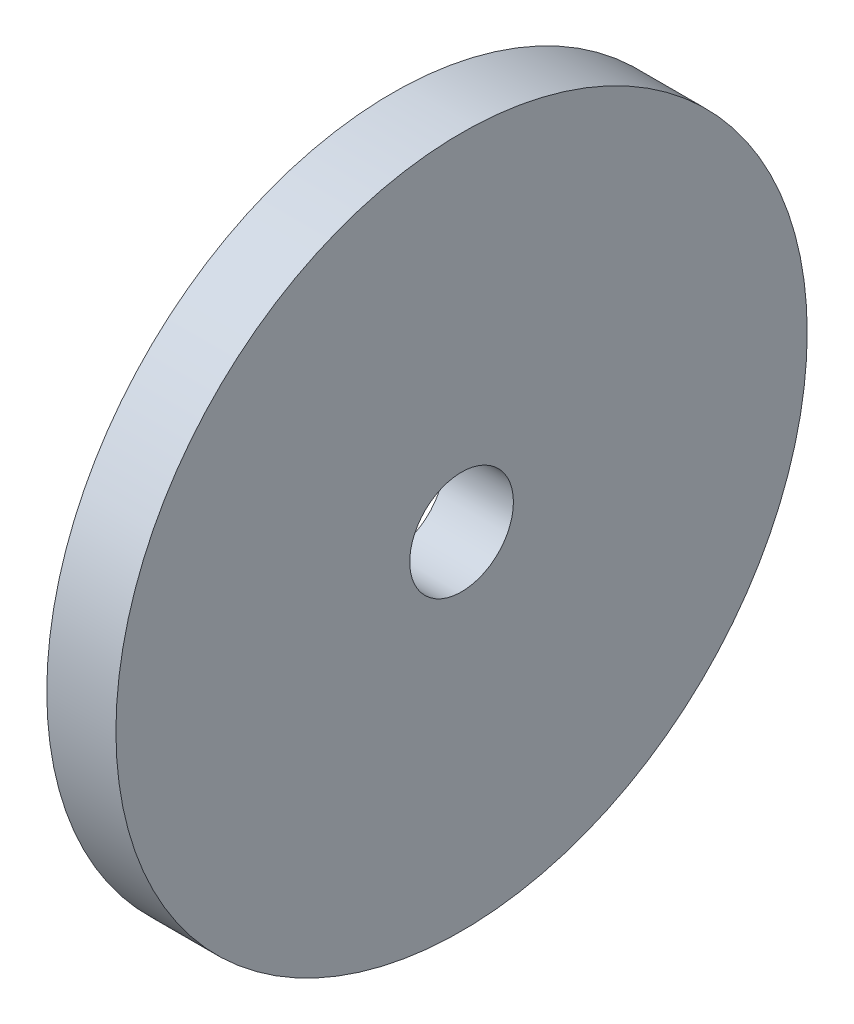
ISO-10303-21;
HEADER;
FILE_DESCRIPTION(('STEP AP214'),'2;1');
FILE_NAME('part.step','',(''),(''),'','','');
FILE_SCHEMA(('AUTOMOTIVE_DESIGN { 1 0 10303 214 1 1 1 1 }'));
ENDSEC;
DATA;
#1=APPLICATION_CONTEXT('core data for automotive mechanical design processes');
#2=APPLICATION_PROTOCOL_DEFINITION('international standard','automotive_design',2000,#1);
#3=PRODUCT_CONTEXT('',#1,'mechanical');
#4=PRODUCT('Part','Part','',(#3));
#5=PRODUCT_RELATED_PRODUCT_CATEGORY('part','',(#4));
#6=PRODUCT_DEFINITION_FORMATION('','',#4);
#7=PRODUCT_DEFINITION_CONTEXT('part definition',#1,'design');
#8=PRODUCT_DEFINITION('design','',#6,#7);
#9=PRODUCT_DEFINITION_SHAPE('','',#8);
#10=(LENGTH_UNIT() NAMED_UNIT(*) SI_UNIT(.MILLI.,.METRE.));
#11=(NAMED_UNIT(*) PLANE_ANGLE_UNIT() SI_UNIT($,.RADIAN.));
#12=(NAMED_UNIT(*) SI_UNIT($,.STERADIAN.) SOLID_ANGLE_UNIT());
#13=UNCERTAINTY_MEASURE_WITH_UNIT(LENGTH_MEASURE(1.E-05),#10,'distance_accuracy_value','');
#14=(GEOMETRIC_REPRESENTATION_CONTEXT(3) GLOBAL_UNCERTAINTY_ASSIGNED_CONTEXT((#13)) GLOBAL_UNIT_ASSIGNED_CONTEXT((#10,
#11,#12)) REPRESENTATION_CONTEXT('',''));
#15=CARTESIAN_POINT('',(0.,0.,0.));
#16=DIRECTION('',(0.,0.,1.));
#17=DIRECTION('',(1.,0.,0.));
#18=AXIS2_PLACEMENT_3D('',#15,#16,#17);
#19=CARTESIAN_POINT('',(2.,0.,0.));
#20=DIRECTION('',(-1.,0.,0.));
#21=DIRECTION('',(0.,0.,1.));
#22=AXIS2_PLACEMENT_3D('',#19,#20,#21);
#23=CYLINDRICAL_SURFACE('',#22,10.);
#24=CARTESIAN_POINT('',(2.,0.,0.));
#25=DIRECTION('',(1.,0.,0.));
#26=DIRECTION('',(0.,0.,-1.));
#27=AXIS2_PLACEMENT_3D('',#24,#25,#26);
#28=CIRCLE('',#27,10.);
#29=CARTESIAN_POINT('',(2.,0.,-10.));
#30=VERTEX_POINT('',#29);
#31=EDGE_CURVE('E10',#30,#30,#28,.T.);
#32=ORIENTED_EDGE('',*,*,#31,.F.);
#33=EDGE_LOOP('',(#32));
#34=FACE_BOUND('',#33,.T.);
#35=CARTESIAN_POINT('',(0.,0.,0.));
#36=DIRECTION('',(1.,0.,0.));
#37=DIRECTION('',(0.,0.,-1.));
#38=AXIS2_PLACEMENT_3D('',#35,#36,#37);
#39=CIRCLE('',#38,10.);
#40=CARTESIAN_POINT('',(0.,0.,-10.));
#41=VERTEX_POINT('',#40);
#42=EDGE_CURVE('E34',#41,#41,#39,.T.);
#43=ORIENTED_EDGE('',*,*,#42,.T.);
#44=EDGE_LOOP('',(#43));
#45=FACE_BOUND('',#44,.T.);
#46=ADVANCED_FACE('F31',(#34,#45),#23,.T.);
#47=CARTESIAN_POINT('',(2.,0.,0.));
#48=DIRECTION('',(1.,0.,0.));
#49=DIRECTION('',(0.,0.,-1.));
#50=AXIS2_PLACEMENT_3D('',#47,#48,#49);
#51=PLANE('',#50);
#52=CARTESIAN_POINT('',(2.,0.,0.));
#53=DIRECTION('',(1.,0.,0.));
#54=DIRECTION('',(0.,0.,-1.));
#55=AXIS2_PLACEMENT_3D('',#52,#53,#54);
#56=CIRCLE('',#55,1.5);
#57=CARTESIAN_POINT('',(2.,0.,-1.5));
#58=VERTEX_POINT('',#57);
#59=EDGE_CURVE('E43',#58,#58,#56,.T.);
#60=ORIENTED_EDGE('',*,*,#59,.F.);
#61=EDGE_LOOP('',(#60));
#62=FACE_BOUND('',#61,.T.);
#63=ORIENTED_EDGE('',*,*,#31,.T.);
#64=EDGE_LOOP('',(#63));
#65=FACE_BOUND('',#64,.T.);
#66=ADVANCED_FACE('F58',(#62,#65),#51,.T.);
#67=CARTESIAN_POINT('',(0.,0.,0.));
#68=DIRECTION('',(1.,0.,0.));
#69=DIRECTION('',(0.,0.,-1.));
#70=AXIS2_PLACEMENT_3D('',#67,#68,#69);
#71=PLANE('',#70);
#72=CARTESIAN_POINT('',(0.,0.,0.));
#73=DIRECTION('',(1.,0.,0.));
#74=DIRECTION('',(0.,0.,-1.));
#75=AXIS2_PLACEMENT_3D('',#72,#73,#74);
#76=CIRCLE('',#75,1.5);
#77=CARTESIAN_POINT('',(0.,0.,-1.5));
#78=VERTEX_POINT('',#77);
#79=EDGE_CURVE('E41',#78,#78,#76,.T.);
#80=ORIENTED_EDGE('',*,*,#79,.T.);
#81=EDGE_LOOP('',(#80));
#82=FACE_BOUND('',#81,.T.);
#83=ORIENTED_EDGE('',*,*,#42,.F.);
#84=EDGE_LOOP('',(#83));
#85=FACE_BOUND('',#84,.T.);
#86=ADVANCED_FACE('F49',(#82,#85),#71,.F.);
#87=CARTESIAN_POINT('',(0.,0.,0.));
#88=DIRECTION('',(1.,0.,0.));
#89=DIRECTION('',(0.,0.,-1.));
#90=AXIS2_PLACEMENT_3D('',#87,#88,#89);
#91=CYLINDRICAL_SURFACE('',#90,1.5);
#92=ORIENTED_EDGE('',*,*,#79,.F.);
#93=EDGE_LOOP('',(#92));
#94=FACE_BOUND('',#93,.T.);
#95=ORIENTED_EDGE('',*,*,#59,.T.);
#96=EDGE_LOOP('',(#95));
#97=FACE_BOUND('',#96,.T.);
#98=ADVANCED_FACE('F52',(#94,#97),#91,.F.);
#99=CLOSED_SHELL('',(#46,#66,#86,#98));
#100=MANIFOLD_SOLID_BREP('B2',#99);
#101=ADVANCED_BREP_SHAPE_REPRESENTATION('',(#18,#100),#14);
#102=SHAPE_DEFINITION_REPRESENTATION(#9,#101);
ENDSEC;
END-ISO-10303-21;
